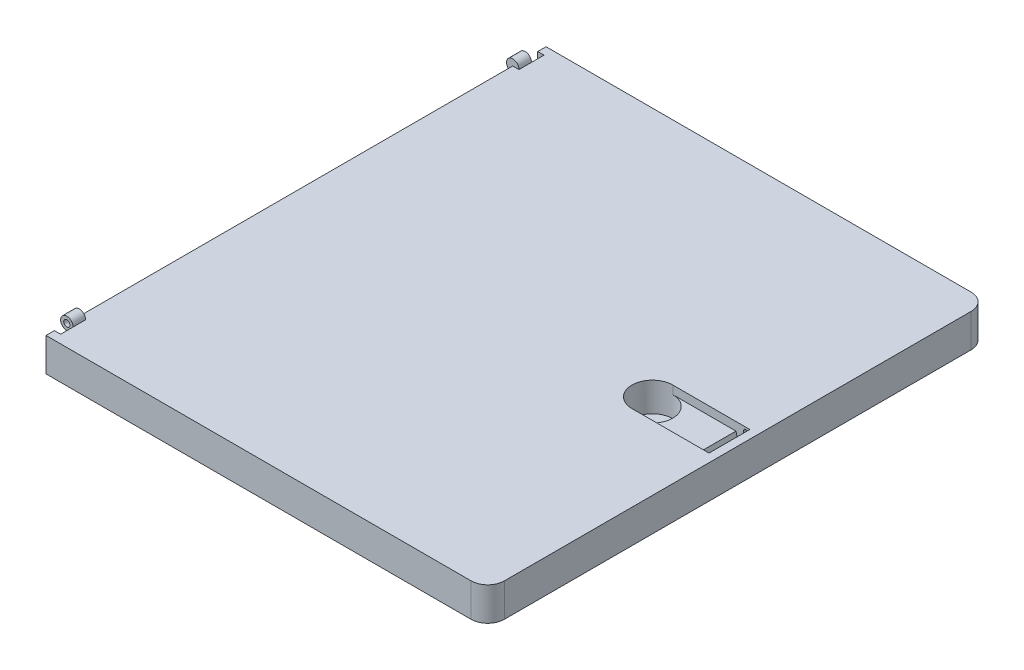
ISO-10303-21;
HEADER;
FILE_DESCRIPTION(('STEP AP214'),'2;1');
FILE_NAME('part.step','',(''),(''),'','','');
FILE_SCHEMA(('AUTOMOTIVE_DESIGN { 1 0 10303 214 1 1 1 1 }'));
ENDSEC;
DATA;
#1=APPLICATION_CONTEXT('core data for automotive mechanical design processes');
#2=APPLICATION_PROTOCOL_DEFINITION('international standard','automotive_design',2000,#1);
#3=PRODUCT_CONTEXT('',#1,'mechanical');
#4=PRODUCT('Part','Part','',(#3));
#5=PRODUCT_RELATED_PRODUCT_CATEGORY('part','',(#4));
#6=PRODUCT_DEFINITION_FORMATION('','',#4);
#7=PRODUCT_DEFINITION_CONTEXT('part definition',#1,'design');
#8=PRODUCT_DEFINITION('design','',#6,#7);
#9=PRODUCT_DEFINITION_SHAPE('','',#8);
#10=(LENGTH_UNIT() NAMED_UNIT(*) SI_UNIT(.MILLI.,.METRE.));
#11=(NAMED_UNIT(*) PLANE_ANGLE_UNIT() SI_UNIT($,.RADIAN.));
#12=(NAMED_UNIT(*) SI_UNIT($,.STERADIAN.) SOLID_ANGLE_UNIT());
#13=UNCERTAINTY_MEASURE_WITH_UNIT(LENGTH_MEASURE(1.E-05),#10,'distance_accuracy_value','');
#14=(GEOMETRIC_REPRESENTATION_CONTEXT(3) GLOBAL_UNCERTAINTY_ASSIGNED_CONTEXT((#13)) GLOBAL_UNIT_ASSIGNED_CONTEXT((#10,
#11,#12)) REPRESENTATION_CONTEXT('',''));
#15=CARTESIAN_POINT('',(0.,0.,0.));
#16=DIRECTION('',(0.,0.,1.));
#17=DIRECTION('',(1.,0.,0.));
#18=AXIS2_PLACEMENT_3D('',#15,#16,#17);
#19=CARTESIAN_POINT('',(-106.,-8.,0.));
#20=DIRECTION('',(-1.,0.,0.));
#21=DIRECTION('',(0.,0.,1.));
#22=AXIS2_PLACEMENT_3D('',#19,#20,#21);
#23=PLANE('',#22);
#24=DIRECTION('',(0.,0.,1.));
#25=VECTOR('',#24,1.);
#26=CARTESIAN_POINT('',(-106.,-1.5,-58.));
#27=LINE('',#26,#25);
#28=CARTESIAN_POINT('',(-106.,-1.5,-58.));
#29=VERTEX_POINT('',#28);
#30=CARTESIAN_POINT('',(-106.,-1.5,-55.));
#31=VERTEX_POINT('',#30);
#32=EDGE_CURVE('E225',#29,#31,#27,.T.);
#33=ORIENTED_EDGE('',*,*,#32,.F.);
#34=DIRECTION('',(0.,-1.,0.));
#35=VECTOR('',#34,1.);
#36=CARTESIAN_POINT('',(-106.,-8.,-58.));
#37=LINE('',#36,#35);
#38=CARTESIAN_POINT('',(-106.,0.,-58.));
#39=VERTEX_POINT('',#38);
#40=EDGE_CURVE('E457',#39,#29,#37,.T.);
#41=ORIENTED_EDGE('',*,*,#40,.F.);
#42=DIRECTION('',(0.,0.,1.));
#43=VECTOR('',#42,1.);
#44=CARTESIAN_POINT('',(-106.,0.,0.));
#45=LINE('',#44,#43);
#46=CARTESIAN_POINT('',(-106.,0.,-60.));
#47=VERTEX_POINT('',#46);
#48=EDGE_CURVE('E294',#47,#39,#45,.T.);
#49=ORIENTED_EDGE('',*,*,#48,.F.);
#50=DIRECTION('',(0.,1.,0.));
#51=VECTOR('',#50,1.);
#52=CARTESIAN_POINT('',(-106.,-8.,-60.));
#53=LINE('',#52,#51);
#54=CARTESIAN_POINT('',(-106.,-8.,-60.));
#55=VERTEX_POINT('',#54);
#56=EDGE_CURVE('E284',#55,#47,#53,.T.);
#57=ORIENTED_EDGE('',*,*,#56,.F.);
#58=DIRECTION('',(0.,0.,1.));
#59=VECTOR('',#58,1.);
#60=CARTESIAN_POINT('',(-106.,-8.,0.));
#61=LINE('',#60,#59);
#62=CARTESIAN_POINT('',(-106.,-8.,60.));
#63=VERTEX_POINT('',#62);
#64=EDGE_CURVE('E306',#55,#63,#61,.T.);
#65=ORIENTED_EDGE('',*,*,#64,.T.);
#66=DIRECTION('',(0.,1.,0.));
#67=VECTOR('',#66,1.);
#68=CARTESIAN_POINT('',(-106.,-8.,60.));
#69=LINE('',#68,#67);
#70=CARTESIAN_POINT('',(-106.,0.,60.));
#71=VERTEX_POINT('',#70);
#72=EDGE_CURVE('E283',#63,#71,#69,.T.);
#73=ORIENTED_EDGE('',*,*,#72,.T.);
#74=CARTESIAN_POINT('',(-106.,0.,58.));
#75=VERTEX_POINT('',#74);
#76=EDGE_CURVE('E297',#75,#71,#45,.T.);
#77=ORIENTED_EDGE('',*,*,#76,.F.);
#78=DIRECTION('',(0.,1.,0.));
#79=VECTOR('',#78,1.);
#80=CARTESIAN_POINT('',(-106.,-8.,58.));
#81=LINE('',#80,#79);
#82=CARTESIAN_POINT('',(-106.,-1.5,58.));
#83=VERTEX_POINT('',#82);
#84=EDGE_CURVE('E433',#83,#75,#81,.T.);
#85=ORIENTED_EDGE('',*,*,#84,.F.);
#86=DIRECTION('',(0.,0.,-1.));
#87=VECTOR('',#86,1.);
#88=CARTESIAN_POINT('',(-106.,-1.5,58.));
#89=LINE('',#88,#87);
#90=CARTESIAN_POINT('',(-106.,-1.5,55.));
#91=VERTEX_POINT('',#90);
#92=EDGE_CURVE('E437',#83,#91,#89,.T.);
#93=ORIENTED_EDGE('',*,*,#92,.T.);
#94=DIRECTION('',(0.,0.,1.));
#95=VECTOR('',#94,1.);
#96=CARTESIAN_POINT('',(-106.,-1.5,52.));
#97=LINE('',#96,#95);
#98=CARTESIAN_POINT('',(-106.,-1.5,52.));
#99=VERTEX_POINT('',#98);
#100=EDGE_CURVE('E407',#99,#91,#97,.T.);
#101=ORIENTED_EDGE('',*,*,#100,.F.);
#102=DIRECTION('',(0.,1.,0.));
#103=VECTOR('',#102,1.);
#104=CARTESIAN_POINT('',(-106.,-8.,52.));
#105=LINE('',#104,#103);
#106=CARTESIAN_POINT('',(-106.,0.,52.));
#107=VERTEX_POINT('',#106);
#108=EDGE_CURVE('E420',#99,#107,#105,.T.);
#109=ORIENTED_EDGE('',*,*,#108,.T.);
#110=CARTESIAN_POINT('',(-106.,0.,-52.));
#111=VERTEX_POINT('',#110);
#112=EDGE_CURVE('E296',#111,#107,#45,.T.);
#113=ORIENTED_EDGE('',*,*,#112,.F.);
#114=DIRECTION('',(0.,-1.,0.));
#115=VECTOR('',#114,1.);
#116=CARTESIAN_POINT('',(-106.,-8.,-52.));
#117=LINE('',#116,#115);
#118=CARTESIAN_POINT('',(-106.,-1.5,-52.));
#119=VERTEX_POINT('',#118);
#120=EDGE_CURVE('E450',#111,#119,#117,.T.);
#121=ORIENTED_EDGE('',*,*,#120,.T.);
#122=DIRECTION('',(0.,0.,-1.));
#123=VECTOR('',#122,1.);
#124=CARTESIAN_POINT('',(-106.,-1.5,-52.));
#125=LINE('',#124,#123);
#126=EDGE_CURVE('E446',#119,#31,#125,.T.);
#127=ORIENTED_EDGE('',*,*,#126,.T.);
#128=EDGE_LOOP('',(#33,#41,#49,#57,#65,#73,#77,#85,#93,#101,#109,#113,#121,#127));
#129=FACE_BOUND('',#128,.T.);
#130=ADVANCED_FACE('F33',(#129),#23,.T.);
#131=CARTESIAN_POINT('',(0.,0.,0.));
#132=DIRECTION('',(0.,-1.,0.));
#133=DIRECTION('',(0.,0.,-1.));
#134=AXIS2_PLACEMENT_3D('',#131,#132,#133);
#135=PLANE('',#134);
#136=DIRECTION('',(0.,0.,-1.));
#137=VECTOR('',#136,1.);
#138=CARTESIAN_POINT('',(-2.,0.,0.));
#139=LINE('',#138,#137);
#140=CARTESIAN_POINT('',(-2.,0.,4.9));
#141=VERTEX_POINT('',#140);
#142=CARTESIAN_POINT('',(-2.,0.,-4.9));
#143=VERTEX_POINT('',#142);
#144=EDGE_CURVE('E330',#141,#143,#139,.T.);
#145=ORIENTED_EDGE('',*,*,#144,.F.);
#146=DIRECTION('',(1.,0.,0.));
#147=VECTOR('',#146,1.);
#148=CARTESIAN_POINT('',(-2.,0.,4.9));
#149=LINE('',#148,#147);
#150=CARTESIAN_POINT('',(-20.5,0.,4.9));
#151=VERTEX_POINT('',#150);
#152=EDGE_CURVE('E321',#151,#141,#149,.T.);
#153=ORIENTED_EDGE('',*,*,#152,.F.);
#154=CARTESIAN_POINT('',(-20.5,0.,0.));
#155=DIRECTION('',(0.,1.,0.));
#156=DIRECTION('',(0.,0.,1.));
#157=AXIS2_PLACEMENT_3D('',#154,#155,#156);
#158=CIRCLE('',#157,4.9);
#159=CARTESIAN_POINT('',(-20.5,0.,-4.9));
#160=VERTEX_POINT('',#159);
#161=EDGE_CURVE('E324',#160,#151,#158,.T.);
#162=ORIENTED_EDGE('',*,*,#161,.F.);
#163=DIRECTION('',(-1.,0.,0.));
#164=VECTOR('',#163,1.);
#165=CARTESIAN_POINT('',(-2.,0.,-4.9));
#166=LINE('',#165,#164);
#167=EDGE_CURVE('E327',#143,#160,#166,.T.);
#168=ORIENTED_EDGE('',*,*,#167,.F.);
#169=EDGE_LOOP('',(#145,#153,#162,#168));
#170=FACE_BOUND('',#169,.T.);
#171=DIRECTION('',(1.,0.,0.));
#172=VECTOR('',#171,1.);
#173=CARTESIAN_POINT('',(0.,0.,-58.));
#174=LINE('',#173,#172);
#175=CARTESIAN_POINT('',(-104.5,0.,-58.));
#176=VERTEX_POINT('',#175);
#177=EDGE_CURVE('E11',#39,#176,#174,.T.);
#178=ORIENTED_EDGE('',*,*,#177,.T.);
#179=DIRECTION('',(0.,0.,1.));
#180=VECTOR('',#179,1.);
#181=CARTESIAN_POINT('',(-104.5,0.,-58.));
#182=LINE('',#181,#180);
#183=CARTESIAN_POINT('',(-104.5,0.,-55.));
#184=VERTEX_POINT('',#183);
#185=EDGE_CURVE('E222',#176,#184,#182,.T.);
#186=ORIENTED_EDGE('',*,*,#185,.T.);
#187=DIRECTION('',(0.,0.,-1.));
#188=VECTOR('',#187,1.);
#189=CARTESIAN_POINT('',(-104.5,0.,-52.));
#190=LINE('',#189,#188);
#191=CARTESIAN_POINT('',(-104.5,0.,-52.));
#192=VERTEX_POINT('',#191);
#193=EDGE_CURVE('E236',#192,#184,#190,.T.);
#194=ORIENTED_EDGE('',*,*,#193,.F.);
#195=DIRECTION('',(1.,0.,0.));
#196=VECTOR('',#195,1.);
#197=CARTESIAN_POINT('',(0.,0.,-52.));
#198=LINE('',#197,#196);
#199=EDGE_CURVE('E41',#111,#192,#198,.T.);
#200=ORIENTED_EDGE('',*,*,#199,.F.);
#201=ORIENTED_EDGE('',*,*,#112,.T.);
#202=DIRECTION('',(-1.,0.,0.));
#203=VECTOR('',#202,1.);
#204=CARTESIAN_POINT('',(0.,0.,52.));
#205=LINE('',#204,#203);
#206=CARTESIAN_POINT('',(-104.5,0.,52.));
#207=VERTEX_POINT('',#206);
#208=EDGE_CURVE('E253',#207,#107,#205,.T.);
#209=ORIENTED_EDGE('',*,*,#208,.F.);
#210=DIRECTION('',(0.,0.,1.));
#211=VECTOR('',#210,1.);
#212=CARTESIAN_POINT('',(-104.5,0.,52.));
#213=LINE('',#212,#211);
#214=CARTESIAN_POINT('',(-104.5,0.,55.));
#215=VERTEX_POINT('',#214);
#216=EDGE_CURVE('E258',#207,#215,#213,.T.);
#217=ORIENTED_EDGE('',*,*,#216,.T.);
#218=DIRECTION('',(0.,0.,-1.));
#219=VECTOR('',#218,1.);
#220=CARTESIAN_POINT('',(-104.5,0.,58.));
#221=LINE('',#220,#219);
#222=CARTESIAN_POINT('',(-104.5,0.,58.));
#223=VERTEX_POINT('',#222);
#224=EDGE_CURVE('E440',#223,#215,#221,.T.);
#225=ORIENTED_EDGE('',*,*,#224,.F.);
#226=DIRECTION('',(-1.,0.,0.));
#227=VECTOR('',#226,1.);
#228=CARTESIAN_POINT('',(0.,0.,58.));
#229=LINE('',#228,#227);
#230=EDGE_CURVE('E250',#223,#75,#229,.T.);
#231=ORIENTED_EDGE('',*,*,#230,.T.);
#232=ORIENTED_EDGE('',*,*,#76,.T.);
#233=DIRECTION('',(1.,0.,0.));
#234=VECTOR('',#233,1.);
#235=CARTESIAN_POINT('',(0.,0.,60.));
#236=LINE('',#235,#234);
#237=CARTESIAN_POINT('',(-4.,0.,60.));
#238=VERTEX_POINT('',#237);
#239=EDGE_CURVE('E290',#71,#238,#236,.T.);
#240=ORIENTED_EDGE('',*,*,#239,.T.);
#241=CARTESIAN_POINT('',(-4.,0.,56.));
#242=DIRECTION('',(0.,-1.,0.));
#243=DIRECTION('',(0.,0.,-1.));
#244=AXIS2_PLACEMENT_3D('',#241,#242,#243);
#245=CIRCLE('',#244,4.);
#246=CARTESIAN_POINT('',(0.,0.,56.));
#247=VERTEX_POINT('',#246);
#248=EDGE_CURVE('E276',#238,#247,#245,.F.);
#249=ORIENTED_EDGE('',*,*,#248,.T.);
#250=DIRECTION('',(0.,0.,-1.));
#251=VECTOR('',#250,1.);
#252=CARTESIAN_POINT('',(0.,0.,0.));
#253=LINE('',#252,#251);
#254=CARTESIAN_POINT('',(0.,0.,-56.));
#255=VERTEX_POINT('',#254);
#256=EDGE_CURVE('E300',#247,#255,#253,.T.);
#257=ORIENTED_EDGE('',*,*,#256,.T.);
#258=CARTESIAN_POINT('',(-4.,0.,-56.));
#259=DIRECTION('',(0.,-1.,0.));
#260=DIRECTION('',(0.,0.,-1.));
#261=AXIS2_PLACEMENT_3D('',#258,#259,#260);
#262=CIRCLE('',#261,4.);
#263=CARTESIAN_POINT('',(-4.,0.,-60.));
#264=VERTEX_POINT('',#263);
#265=EDGE_CURVE('E278',#255,#264,#262,.F.);
#266=ORIENTED_EDGE('',*,*,#265,.T.);
#267=DIRECTION('',(-1.,0.,0.));
#268=VECTOR('',#267,1.);
#269=CARTESIAN_POINT('',(0.,0.,-60.));
#270=LINE('',#269,#268);
#271=EDGE_CURVE('E298',#264,#47,#270,.T.);
#272=ORIENTED_EDGE('',*,*,#271,.T.);
#273=ORIENTED_EDGE('',*,*,#48,.T.);
#274=EDGE_LOOP('',(#178,#186,#194,#200,#201,#209,#217,#225,#231,#232,#240,#249,#257,#266,#272,#273));
#275=FACE_BOUND('',#274,.T.);
#276=ADVANCED_FACE('F233',(#170,#275),#135,.F.);
#277=CARTESIAN_POINT('',(0.,-8.,60.));
#278=DIRECTION('',(0.,0.,1.));
#279=DIRECTION('',(1.,0.,0.));
#280=AXIS2_PLACEMENT_3D('',#277,#278,#279);
#281=PLANE('',#280);
#282=DIRECTION('',(1.,0.,0.));
#283=VECTOR('',#282,1.);
#284=CARTESIAN_POINT('',(0.,-8.,60.));
#285=LINE('',#284,#283);
#286=CARTESIAN_POINT('',(-4.,-8.,60.));
#287=VERTEX_POINT('',#286);
#288=EDGE_CURVE('E287',#63,#287,#285,.T.);
#289=ORIENTED_EDGE('',*,*,#288,.T.);
#290=DIRECTION('',(0.,1.,0.));
#291=VECTOR('',#290,1.);
#292=CARTESIAN_POINT('',(-4.,-8.,60.));
#293=LINE('',#292,#291);
#294=EDGE_CURVE('E280',#287,#238,#293,.T.);
#295=ORIENTED_EDGE('',*,*,#294,.T.);
#296=ORIENTED_EDGE('',*,*,#239,.F.);
#297=ORIENTED_EDGE('',*,*,#72,.F.);
#298=EDGE_LOOP('',(#289,#295,#296,#297));
#299=FACE_BOUND('',#298,.T.);
#300=ADVANCED_FACE('F481',(#299),#281,.T.);
#301=CARTESIAN_POINT('',(0.,-8.,-60.));
#302=DIRECTION('',(0.,0.,-1.));
#303=DIRECTION('',(-1.,0.,0.));
#304=AXIS2_PLACEMENT_3D('',#301,#302,#303);
#305=PLANE('',#304);
#306=ORIENTED_EDGE('',*,*,#271,.F.);
#307=DIRECTION('',(0.,1.,0.));
#308=VECTOR('',#307,1.);
#309=CARTESIAN_POINT('',(-4.,-8.,-60.));
#310=LINE('',#309,#308);
#311=CARTESIAN_POINT('',(-4.,-8.,-60.));
#312=VERTEX_POINT('',#311);
#313=EDGE_CURVE('E265',#264,#312,#310,.F.);
#314=ORIENTED_EDGE('',*,*,#313,.T.);
#315=DIRECTION('',(-1.,0.,0.));
#316=VECTOR('',#315,1.);
#317=CARTESIAN_POINT('',(0.,-8.,-60.));
#318=LINE('',#317,#316);
#319=EDGE_CURVE('E308',#312,#55,#318,.T.);
#320=ORIENTED_EDGE('',*,*,#319,.T.);
#321=ORIENTED_EDGE('',*,*,#56,.T.);
#322=EDGE_LOOP('',(#306,#314,#320,#321));
#323=FACE_BOUND('',#322,.T.);
#324=ADVANCED_FACE('F498',(#323),#305,.T.);
#325=CARTESIAN_POINT('',(0.,-8.,0.));
#326=DIRECTION('',(1.,0.,0.));
#327=DIRECTION('',(0.,0.,-1.));
#328=AXIS2_PLACEMENT_3D('',#325,#326,#327);
#329=PLANE('',#328);
#330=ORIENTED_EDGE('',*,*,#256,.F.);
#331=DIRECTION('',(0.,1.,0.));
#332=VECTOR('',#331,1.);
#333=CARTESIAN_POINT('',(0.,-8.,56.));
#334=LINE('',#333,#332);
#335=CARTESIAN_POINT('',(0.,-8.,56.));
#336=VERTEX_POINT('',#335);
#337=EDGE_CURVE('E271',#247,#336,#334,.F.);
#338=ORIENTED_EDGE('',*,*,#337,.T.);
#339=DIRECTION('',(0.,0.,-1.));
#340=VECTOR('',#339,1.);
#341=CARTESIAN_POINT('',(0.,-8.,0.));
#342=LINE('',#341,#340);
#343=CARTESIAN_POINT('',(0.,-8.,-56.));
#344=VERTEX_POINT('',#343);
#345=EDGE_CURVE('E293',#336,#344,#342,.T.);
#346=ORIENTED_EDGE('',*,*,#345,.T.);
#347=DIRECTION('',(0.,1.,0.));
#348=VECTOR('',#347,1.);
#349=CARTESIAN_POINT('',(0.,-8.,-56.));
#350=LINE('',#349,#348);
#351=EDGE_CURVE('E273',#344,#255,#350,.T.);
#352=ORIENTED_EDGE('',*,*,#351,.T.);
#353=EDGE_LOOP('',(#330,#338,#346,#352));
#354=FACE_BOUND('',#353,.T.);
#355=ADVANCED_FACE('F489',(#354),#329,.T.);
#356=CARTESIAN_POINT('',(0.,-8.,0.));
#357=DIRECTION('',(0.,-1.,0.));
#358=DIRECTION('',(0.,0.,-1.));
#359=AXIS2_PLACEMENT_3D('',#356,#357,#358);
#360=PLANE('',#359);
#361=ORIENTED_EDGE('',*,*,#345,.F.);
#362=CARTESIAN_POINT('',(-4.,-8.,56.));
#363=DIRECTION('',(0.,-1.,0.));
#364=DIRECTION('',(0.,0.,-1.));
#365=AXIS2_PLACEMENT_3D('',#362,#363,#364);
#366=CIRCLE('',#365,4.);
#367=EDGE_CURVE('E267',#336,#287,#366,.T.);
#368=ORIENTED_EDGE('',*,*,#367,.T.);
#369=ORIENTED_EDGE('',*,*,#288,.F.);
#370=ORIENTED_EDGE('',*,*,#64,.F.);
#371=ORIENTED_EDGE('',*,*,#319,.F.);
#372=CARTESIAN_POINT('',(-4.,-8.,-56.));
#373=DIRECTION('',(0.,-1.,0.));
#374=DIRECTION('',(0.,0.,-1.));
#375=AXIS2_PLACEMENT_3D('',#372,#373,#374);
#376=CIRCLE('',#375,4.);
#377=EDGE_CURVE('E269',#312,#344,#376,.T.);
#378=ORIENTED_EDGE('',*,*,#377,.T.);
#379=EDGE_LOOP('',(#361,#368,#369,#370,#371,#378));
#380=FACE_BOUND('',#379,.T.);
#381=ADVANCED_FACE('F501',(#380),#360,.T.);
#382=CARTESIAN_POINT('',(-4.,-8.,56.));
#383=DIRECTION('',(0.,1.,0.));
#384=DIRECTION('',(0.,0.,1.));
#385=AXIS2_PLACEMENT_3D('',#382,#383,#384);
#386=CYLINDRICAL_SURFACE('',#385,4.);
#387=ORIENTED_EDGE('',*,*,#367,.F.);
#388=ORIENTED_EDGE('',*,*,#337,.F.);
#389=ORIENTED_EDGE('',*,*,#248,.F.);
#390=ORIENTED_EDGE('',*,*,#294,.F.);
#391=EDGE_LOOP('',(#387,#388,#389,#390));
#392=FACE_BOUND('',#391,.T.);
#393=ADVANCED_FACE('F485',(#392),#386,.T.);
#394=CARTESIAN_POINT('',(-4.,-8.,-56.));
#395=DIRECTION('',(0.,1.,0.));
#396=DIRECTION('',(0.,0.,1.));
#397=AXIS2_PLACEMENT_3D('',#394,#395,#396);
#398=CYLINDRICAL_SURFACE('',#397,4.);
#399=ORIENTED_EDGE('',*,*,#377,.F.);
#400=ORIENTED_EDGE('',*,*,#313,.F.);
#401=ORIENTED_EDGE('',*,*,#265,.F.);
#402=ORIENTED_EDGE('',*,*,#351,.F.);
#403=EDGE_LOOP('',(#399,#400,#401,#402));
#404=FACE_BOUND('',#403,.T.);
#405=ADVANCED_FACE('F494',(#404),#398,.T.);
#406=CARTESIAN_POINT('',(-2.,-2.,4.9));
#407=DIRECTION('',(0.,0.,1.));
#408=DIRECTION('',(1.,0.,0.));
#409=AXIS2_PLACEMENT_3D('',#406,#407,#408);
#410=PLANE('',#409);
#411=DIRECTION('',(0.,-1.,0.));
#412=VECTOR('',#411,1.);
#413=CARTESIAN_POINT('',(-2.5,-1.,4.9));
#414=LINE('',#413,#412);
#415=CARTESIAN_POINT('',(-2.5,-1.,4.9));
#416=VERTEX_POINT('',#415);
#417=CARTESIAN_POINT('',(-2.5,-6.,4.9));
#418=VERTEX_POINT('',#417);
#419=EDGE_CURVE('E402',#416,#418,#414,.T.);
#420=ORIENTED_EDGE('',*,*,#419,.F.);
#421=CARTESIAN_POINT('',(-3.,-1.,4.9));
#422=DIRECTION('',(0.,0.,-1.));
#423=DIRECTION('',(-1.,0.,0.));
#424=AXIS2_PLACEMENT_3D('',#421,#422,#423);
#425=CIRCLE('',#424,0.5);
#426=CARTESIAN_POINT('',(-3.5,-1.,4.9));
#427=VERTEX_POINT('',#426);
#428=EDGE_CURVE('E405',#427,#416,#425,.T.);
#429=ORIENTED_EDGE('',*,*,#428,.F.);
#430=DIRECTION('',(0.,1.,0.));
#431=VECTOR('',#430,1.);
#432=CARTESIAN_POINT('',(-3.5,-1.,4.9));
#433=LINE('',#432,#431);
#434=CARTESIAN_POINT('',(-3.5,-6.,4.9));
#435=VERTEX_POINT('',#434);
#436=EDGE_CURVE('E395',#435,#427,#433,.T.);
#437=ORIENTED_EDGE('',*,*,#436,.F.);
#438=CARTESIAN_POINT('',(-3.,-6.,4.9));
#439=DIRECTION('',(0.,0.,-1.));
#440=DIRECTION('',(-1.,0.,0.));
#441=AXIS2_PLACEMENT_3D('',#438,#439,#440);
#442=CIRCLE('',#441,0.5);
#443=EDGE_CURVE('E399',#418,#435,#442,.T.);
#444=ORIENTED_EDGE('',*,*,#443,.F.);
#445=EDGE_LOOP('',(#420,#429,#437,#444));
#446=FACE_BOUND('',#445,.T.);
#447=ORIENTED_EDGE('',*,*,#152,.T.);
#448=DIRECTION('',(0.,1.,0.));
#449=VECTOR('',#448,1.);
#450=CARTESIAN_POINT('',(-2.,-2.,4.9));
#451=LINE('',#450,#449);
#452=CARTESIAN_POINT('',(-2.,-7.,4.9));
#453=VERTEX_POINT('',#452);
#454=EDGE_CURVE('E303',#453,#141,#451,.T.);
#455=ORIENTED_EDGE('',*,*,#454,.F.);
#456=DIRECTION('',(1.,0.,0.));
#457=VECTOR('',#456,1.);
#458=CARTESIAN_POINT('',(-2.,-7.,4.9));
#459=LINE('',#458,#457);
#460=CARTESIAN_POINT('',(-4.,-7.,4.9));
#461=VERTEX_POINT('',#460);
#462=EDGE_CURVE('E339',#461,#453,#459,.T.);
#463=ORIENTED_EDGE('',*,*,#462,.F.);
#464=DIRECTION('',(-0.258819045102518,0.965925826289069,0.));
#465=VECTOR('',#464,1.);
#466=CARTESIAN_POINT('',(-5.11602540378444,-2.83493649053889,4.9));
#467=LINE('',#466,#465);
#468=CARTESIAN_POINT('',(-5.33974596215561,-2.,4.9));
#469=VERTEX_POINT('',#468);
#470=EDGE_CURVE('E48',#461,#469,#467,.T.);
#471=ORIENTED_EDGE('',*,*,#470,.T.);
#472=DIRECTION('',(1.,0.,0.));
#473=VECTOR('',#472,1.);
#474=CARTESIAN_POINT('',(-2.,-2.,4.9));
#475=LINE('',#474,#473);
#476=CARTESIAN_POINT('',(-20.5,-2.,4.9));
#477=VERTEX_POINT('',#476);
#478=EDGE_CURVE('E315',#477,#469,#475,.T.);
#479=ORIENTED_EDGE('',*,*,#478,.F.);
#480=DIRECTION('',(0.,1.,0.));
#481=VECTOR('',#480,1.);
#482=CARTESIAN_POINT('',(-20.5,-2.,4.9));
#483=LINE('',#482,#481);
#484=EDGE_CURVE('E317',#477,#151,#483,.T.);
#485=ORIENTED_EDGE('',*,*,#484,.T.);
#486=EDGE_LOOP('',(#447,#455,#463,#471,#479,#485));
#487=FACE_BOUND('',#486,.T.);
#488=ADVANCED_FACE('F522',(#446,#487),#410,.F.);
#489=CARTESIAN_POINT('',(-20.5,-2.,0.));
#490=DIRECTION('',(0.,1.,0.));
#491=DIRECTION('',(0.,0.,1.));
#492=AXIS2_PLACEMENT_3D('',#489,#490,#491);
#493=CYLINDRICAL_SURFACE('',#492,4.9);
#494=ORIENTED_EDGE('',*,*,#161,.T.);
#495=ORIENTED_EDGE('',*,*,#484,.F.);
#496=CARTESIAN_POINT('',(-20.5,-2.,0.));
#497=DIRECTION('',(0.,1.,0.));
#498=DIRECTION('',(0.,0.,1.));
#499=AXIS2_PLACEMENT_3D('',#496,#497,#498);
#500=CIRCLE('',#499,4.9);
#501=CARTESIAN_POINT('',(-20.5,-2.,-4.9));
#502=VERTEX_POINT('',#501);
#503=EDGE_CURVE('E336',#477,#502,#500,.T.);
#504=ORIENTED_EDGE('',*,*,#503,.T.);
#505=DIRECTION('',(0.,1.,0.));
#506=VECTOR('',#505,1.);
#507=CARTESIAN_POINT('',(-20.5,-2.,-4.9));
#508=LINE('',#507,#506);
#509=EDGE_CURVE('E314',#502,#160,#508,.T.);
#510=ORIENTED_EDGE('',*,*,#509,.T.);
#511=EDGE_LOOP('',(#494,#495,#504,#510));
#512=FACE_BOUND('',#511,.T.);
#513=CARTESIAN_POINT('',(-20.5,-7.,0.));
#514=DIRECTION('',(0.,1.,0.));
#515=DIRECTION('',(0.,0.,1.));
#516=AXIS2_PLACEMENT_3D('',#513,#514,#515);
#517=CIRCLE('',#516,4.9);
#518=CARTESIAN_POINT('',(-20.5,-7.,4.9));
#519=VERTEX_POINT('',#518);
#520=EDGE_CURVE('E333',#519,#519,#517,.T.);
#521=ORIENTED_EDGE('',*,*,#520,.F.);
#522=EDGE_LOOP('',(#521));
#523=FACE_BOUND('',#522,.T.);
#524=ADVANCED_FACE('F526',(#512,#523),#493,.F.);
#525=CARTESIAN_POINT('',(-2.,-2.,-4.9));
#526=DIRECTION('',(0.,0.,-1.));
#527=DIRECTION('',(-1.,0.,0.));
#528=AXIS2_PLACEMENT_3D('',#525,#526,#527);
#529=PLANE('',#528);
#530=DIRECTION('',(0.,-1.,0.));
#531=VECTOR('',#530,1.);
#532=CARTESIAN_POINT('',(-3.5,-1.,-4.9));
#533=LINE('',#532,#531);
#534=CARTESIAN_POINT('',(-3.5,-1.,-4.9));
#535=VERTEX_POINT('',#534);
#536=CARTESIAN_POINT('',(-3.5,-6.,-4.9));
#537=VERTEX_POINT('',#536);
#538=EDGE_CURVE('E370',#535,#537,#533,.T.);
#539=ORIENTED_EDGE('',*,*,#538,.F.);
#540=CARTESIAN_POINT('',(-3.,-1.,-4.9));
#541=DIRECTION('',(0.,0.,1.));
#542=DIRECTION('',(1.,0.,0.));
#543=AXIS2_PLACEMENT_3D('',#540,#541,#542);
#544=CIRCLE('',#543,0.5);
#545=CARTESIAN_POINT('',(-2.5,-1.,-4.9));
#546=VERTEX_POINT('',#545);
#547=EDGE_CURVE('E373',#546,#535,#544,.T.);
#548=ORIENTED_EDGE('',*,*,#547,.F.);
#549=DIRECTION('',(0.,1.,0.));
#550=VECTOR('',#549,1.);
#551=CARTESIAN_POINT('',(-2.5,-6.,-4.9));
#552=LINE('',#551,#550);
#553=CARTESIAN_POINT('',(-2.5,-6.,-4.9));
#554=VERTEX_POINT('',#553);
#555=EDGE_CURVE('E363',#554,#546,#552,.T.);
#556=ORIENTED_EDGE('',*,*,#555,.F.);
#557=CARTESIAN_POINT('',(-3.,-6.,-4.9));
#558=DIRECTION('',(0.,0.,1.));
#559=DIRECTION('',(1.,0.,0.));
#560=AXIS2_PLACEMENT_3D('',#557,#558,#559);
#561=CIRCLE('',#560,0.5);
#562=EDGE_CURVE('E367',#537,#554,#561,.T.);
#563=ORIENTED_EDGE('',*,*,#562,.F.);
#564=EDGE_LOOP('',(#539,#548,#556,#563));
#565=FACE_BOUND('',#564,.T.);
#566=ORIENTED_EDGE('',*,*,#167,.T.);
#567=ORIENTED_EDGE('',*,*,#509,.F.);
#568=DIRECTION('',(-1.,0.,0.));
#569=VECTOR('',#568,1.);
#570=CARTESIAN_POINT('',(-2.,-2.,-4.9));
#571=LINE('',#570,#569);
#572=CARTESIAN_POINT('',(-5.33974596215561,-2.,-4.9));
#573=VERTEX_POINT('',#572);
#574=EDGE_CURVE('E323',#573,#502,#571,.T.);
#575=ORIENTED_EDGE('',*,*,#574,.F.);
#576=DIRECTION('',(0.258819045102518,-0.965925826289069,0.));
#577=VECTOR('',#576,1.);
#578=CARTESIAN_POINT('',(-5.11602540378444,-2.83493649053889,-4.9));
#579=LINE('',#578,#577);
#580=CARTESIAN_POINT('',(-4.,-7.,-4.9));
#581=VERTEX_POINT('',#580);
#582=EDGE_CURVE('E261',#573,#581,#579,.T.);
#583=ORIENTED_EDGE('',*,*,#582,.T.);
#584=DIRECTION('',(-1.,0.,0.));
#585=VECTOR('',#584,1.);
#586=CARTESIAN_POINT('',(-2.,-7.,-4.9));
#587=LINE('',#586,#585);
#588=CARTESIAN_POINT('',(-2.,-7.,-4.9));
#589=VERTEX_POINT('',#588);
#590=EDGE_CURVE('E347',#589,#581,#587,.T.);
#591=ORIENTED_EDGE('',*,*,#590,.F.);
#592=DIRECTION('',(0.,1.,0.));
#593=VECTOR('',#592,1.);
#594=CARTESIAN_POINT('',(-2.,-2.,-4.9));
#595=LINE('',#594,#593);
#596=EDGE_CURVE('E312',#589,#143,#595,.T.);
#597=ORIENTED_EDGE('',*,*,#596,.T.);
#598=EDGE_LOOP('',(#566,#567,#575,#583,#591,#597));
#599=FACE_BOUND('',#598,.T.);
#600=ADVANCED_FACE('F532',(#565,#599),#529,.F.);
#601=CARTESIAN_POINT('',(-2.,-2.,0.));
#602=DIRECTION('',(1.,0.,0.));
#603=DIRECTION('',(0.,0.,-1.));
#604=AXIS2_PLACEMENT_3D('',#601,#602,#603);
#605=PLANE('',#604);
#606=ORIENTED_EDGE('',*,*,#144,.T.);
#607=ORIENTED_EDGE('',*,*,#596,.F.);
#608=DIRECTION('',(0.,0.,-1.));
#609=VECTOR('',#608,1.);
#610=CARTESIAN_POINT('',(-2.,-7.,-4.9));
#611=LINE('',#610,#609);
#612=EDGE_CURVE('E350',#453,#589,#611,.T.);
#613=ORIENTED_EDGE('',*,*,#612,.F.);
#614=ORIENTED_EDGE('',*,*,#454,.T.);
#615=EDGE_LOOP('',(#606,#607,#613,#614));
#616=FACE_BOUND('',#615,.T.);
#617=ADVANCED_FACE('F541',(#616),#605,.F.);
#618=CARTESIAN_POINT('',(-20.5,-2.,0.));
#619=DIRECTION('',(0.,1.,0.));
#620=DIRECTION('',(0.,0.,1.));
#621=AXIS2_PLACEMENT_3D('',#618,#619,#620);
#622=PLANE('',#621);
#623=ORIENTED_EDGE('',*,*,#478,.T.);
#624=DIRECTION('',(0.,0.,-1.));
#625=VECTOR('',#624,1.);
#626=CARTESIAN_POINT('',(-5.33974596215561,-2.,-4.9));
#627=LINE('',#626,#625);
#628=EDGE_CURVE('E55',#469,#573,#627,.T.);
#629=ORIENTED_EDGE('',*,*,#628,.T.);
#630=ORIENTED_EDGE('',*,*,#574,.T.);
#631=ORIENTED_EDGE('',*,*,#503,.F.);
#632=EDGE_LOOP('',(#623,#629,#630,#631));
#633=FACE_BOUND('',#632,.T.);
#634=ADVANCED_FACE('F537',(#633),#622,.T.);
#635=CARTESIAN_POINT('',(-20.5,-7.,0.));
#636=DIRECTION('',(0.,1.,0.));
#637=DIRECTION('',(0.,0.,1.));
#638=AXIS2_PLACEMENT_3D('',#635,#636,#637);
#639=PLANE('',#638);
#640=ORIENTED_EDGE('',*,*,#520,.T.);
#641=EDGE_LOOP('',(#640));
#642=FACE_BOUND('',#641,.T.);
#643=ADVANCED_FACE('F548',(#642),#639,.T.);
#644=CARTESIAN_POINT('',(0.,-7.,0.));
#645=DIRECTION('',(0.,-1.,0.));
#646=DIRECTION('',(0.,0.,-1.));
#647=AXIS2_PLACEMENT_3D('',#644,#645,#646);
#648=PLANE('',#647);
#649=ORIENTED_EDGE('',*,*,#612,.T.);
#650=ORIENTED_EDGE('',*,*,#590,.T.);
#651=DIRECTION('',(0.,0.,1.));
#652=VECTOR('',#651,1.);
#653=CARTESIAN_POINT('',(-4.,-7.,-4.9));
#654=LINE('',#653,#652);
#655=EDGE_CURVE('E344',#581,#461,#654,.T.);
#656=ORIENTED_EDGE('',*,*,#655,.T.);
#657=ORIENTED_EDGE('',*,*,#462,.T.);
#658=EDGE_LOOP('',(#649,#650,#656,#657));
#659=FACE_BOUND('',#658,.T.);
#660=ADVANCED_FACE('F560',(#659),#648,.F.);
#661=CARTESIAN_POINT('',(-3.,-1.,-6.9));
#662=DIRECTION('',(0.,0.,1.));
#663=DIRECTION('',(1.,0.,0.));
#664=AXIS2_PLACEMENT_3D('',#661,#662,#663);
#665=CYLINDRICAL_SURFACE('',#664,0.5);
#666=ORIENTED_EDGE('',*,*,#547,.T.);
#667=DIRECTION('',(0.,0.,1.));
#668=VECTOR('',#667,1.);
#669=CARTESIAN_POINT('',(-3.5,-1.,-6.9));
#670=LINE('',#669,#668);
#671=CARTESIAN_POINT('',(-3.5,-1.,-6.9));
#672=VERTEX_POINT('',#671);
#673=EDGE_CURVE('E354',#672,#535,#670,.T.);
#674=ORIENTED_EDGE('',*,*,#673,.F.);
#675=CARTESIAN_POINT('',(-3.,-1.,-6.9));
#676=DIRECTION('',(0.,0.,1.));
#677=DIRECTION('',(1.,0.,0.));
#678=AXIS2_PLACEMENT_3D('',#675,#676,#677);
#679=CIRCLE('',#678,0.5);
#680=CARTESIAN_POINT('',(-2.5,-1.,-6.9));
#681=VERTEX_POINT('',#680);
#682=EDGE_CURVE('E366',#681,#672,#679,.T.);
#683=ORIENTED_EDGE('',*,*,#682,.F.);
#684=DIRECTION('',(0.,0.,1.));
#685=VECTOR('',#684,1.);
#686=CARTESIAN_POINT('',(-2.5,-1.,-6.9));
#687=LINE('',#686,#685);
#688=EDGE_CURVE('E353',#681,#546,#687,.T.);
#689=ORIENTED_EDGE('',*,*,#688,.T.);
#690=EDGE_LOOP('',(#666,#674,#683,#689));
#691=FACE_BOUND('',#690,.T.);
#692=ADVANCED_FACE('F605',(#691),#665,.F.);
#693=CARTESIAN_POINT('',(-2.5,-6.,-6.9));
#694=DIRECTION('',(1.,0.,0.));
#695=DIRECTION('',(0.,0.,-1.));
#696=AXIS2_PLACEMENT_3D('',#693,#694,#695);
#697=PLANE('',#696);
#698=ORIENTED_EDGE('',*,*,#555,.T.);
#699=ORIENTED_EDGE('',*,*,#688,.F.);
#700=DIRECTION('',(0.,1.,0.));
#701=VECTOR('',#700,1.);
#702=CARTESIAN_POINT('',(-2.5,-6.,-6.9));
#703=LINE('',#702,#701);
#704=CARTESIAN_POINT('',(-2.5,-6.,-6.9));
#705=VERTEX_POINT('',#704);
#706=EDGE_CURVE('E358',#705,#681,#703,.T.);
#707=ORIENTED_EDGE('',*,*,#706,.F.);
#708=DIRECTION('',(0.,0.,1.));
#709=VECTOR('',#708,1.);
#710=CARTESIAN_POINT('',(-2.5,-6.,-6.9));
#711=LINE('',#710,#709);
#712=EDGE_CURVE('E360',#705,#554,#711,.T.);
#713=ORIENTED_EDGE('',*,*,#712,.T.);
#714=EDGE_LOOP('',(#698,#699,#707,#713));
#715=FACE_BOUND('',#714,.T.);
#716=ADVANCED_FACE('F601',(#715),#697,.F.);
#717=CARTESIAN_POINT('',(-3.,-6.,-6.9));
#718=DIRECTION('',(0.,0.,1.));
#719=DIRECTION('',(1.,0.,0.));
#720=AXIS2_PLACEMENT_3D('',#717,#718,#719);
#721=CYLINDRICAL_SURFACE('',#720,0.5);
#722=ORIENTED_EDGE('',*,*,#562,.T.);
#723=ORIENTED_EDGE('',*,*,#712,.F.);
#724=CARTESIAN_POINT('',(-3.,-6.,-6.9));
#725=DIRECTION('',(0.,0.,1.));
#726=DIRECTION('',(1.,0.,0.));
#727=AXIS2_PLACEMENT_3D('',#724,#725,#726);
#728=CIRCLE('',#727,0.5);
#729=CARTESIAN_POINT('',(-3.5,-6.,-6.9));
#730=VERTEX_POINT('',#729);
#731=EDGE_CURVE('E378',#730,#705,#728,.T.);
#732=ORIENTED_EDGE('',*,*,#731,.F.);
#733=DIRECTION('',(0.,0.,1.));
#734=VECTOR('',#733,1.);
#735=CARTESIAN_POINT('',(-3.5,-6.,-6.9));
#736=LINE('',#735,#734);
#737=EDGE_CURVE('E357',#730,#537,#736,.T.);
#738=ORIENTED_EDGE('',*,*,#737,.T.);
#739=EDGE_LOOP('',(#722,#723,#732,#738));
#740=FACE_BOUND('',#739,.T.);
#741=ADVANCED_FACE('F604',(#740),#721,.F.);
#742=CARTESIAN_POINT('',(-3.5,-1.,-6.9));
#743=DIRECTION('',(-1.,0.,0.));
#744=DIRECTION('',(0.,0.,1.));
#745=AXIS2_PLACEMENT_3D('',#742,#743,#744);
#746=PLANE('',#745);
#747=ORIENTED_EDGE('',*,*,#538,.T.);
#748=ORIENTED_EDGE('',*,*,#737,.F.);
#749=DIRECTION('',(0.,-1.,0.));
#750=VECTOR('',#749,1.);
#751=CARTESIAN_POINT('',(-3.5,-1.,-6.9));
#752=LINE('',#751,#750);
#753=EDGE_CURVE('E381',#672,#730,#752,.T.);
#754=ORIENTED_EDGE('',*,*,#753,.F.);
#755=ORIENTED_EDGE('',*,*,#673,.T.);
#756=EDGE_LOOP('',(#747,#748,#754,#755));
#757=FACE_BOUND('',#756,.T.);
#758=ADVANCED_FACE('F599',(#757),#746,.F.);
#759=CARTESIAN_POINT('',(-3.,-1.,-6.9));
#760=DIRECTION('',(0.,0.,1.));
#761=DIRECTION('',(1.,0.,0.));
#762=AXIS2_PLACEMENT_3D('',#759,#760,#761);
#763=PLANE('',#762);
#764=ORIENTED_EDGE('',*,*,#682,.T.);
#765=ORIENTED_EDGE('',*,*,#753,.T.);
#766=ORIENTED_EDGE('',*,*,#731,.T.);
#767=ORIENTED_EDGE('',*,*,#706,.T.);
#768=EDGE_LOOP('',(#764,#765,#766,#767));
#769=FACE_BOUND('',#768,.T.);
#770=ADVANCED_FACE('F595',(#769),#763,.T.);
#771=CARTESIAN_POINT('',(-3.,-1.,6.9));
#772=DIRECTION('',(0.,0.,-1.));
#773=DIRECTION('',(-1.,0.,0.));
#774=AXIS2_PLACEMENT_3D('',#771,#772,#773);
#775=CYLINDRICAL_SURFACE('',#774,0.5);
#776=ORIENTED_EDGE('',*,*,#428,.T.);
#777=DIRECTION('',(0.,0.,-1.));
#778=VECTOR('',#777,1.);
#779=CARTESIAN_POINT('',(-2.5,-1.,6.9));
#780=LINE('',#779,#778);
#781=CARTESIAN_POINT('',(-2.5,-1.,6.9));
#782=VERTEX_POINT('',#781);
#783=EDGE_CURVE('E386',#782,#416,#780,.T.);
#784=ORIENTED_EDGE('',*,*,#783,.F.);
#785=CARTESIAN_POINT('',(-3.,-1.,6.9));
#786=DIRECTION('',(0.,0.,-1.));
#787=DIRECTION('',(-1.,0.,0.));
#788=AXIS2_PLACEMENT_3D('',#785,#786,#787);
#789=CIRCLE('',#788,0.5);
#790=CARTESIAN_POINT('',(-3.5,-1.,6.9));
#791=VERTEX_POINT('',#790);
#792=EDGE_CURVE('E398',#791,#782,#789,.T.);
#793=ORIENTED_EDGE('',*,*,#792,.F.);
#794=DIRECTION('',(0.,0.,-1.));
#795=VECTOR('',#794,1.);
#796=CARTESIAN_POINT('',(-3.5,-1.,6.9));
#797=LINE('',#796,#795);
#798=EDGE_CURVE('E375',#791,#427,#797,.T.);
#799=ORIENTED_EDGE('',*,*,#798,.T.);
#800=EDGE_LOOP('',(#776,#784,#793,#799));
#801=FACE_BOUND('',#800,.T.);
#802=ADVANCED_FACE('F588',(#801),#775,.F.);
#803=CARTESIAN_POINT('',(-3.5,-1.,6.9));
#804=DIRECTION('',(-1.,0.,0.));
#805=DIRECTION('',(0.,0.,1.));
#806=AXIS2_PLACEMENT_3D('',#803,#804,#805);
#807=PLANE('',#806);
#808=ORIENTED_EDGE('',*,*,#436,.T.);
#809=ORIENTED_EDGE('',*,*,#798,.F.);
#810=DIRECTION('',(0.,1.,0.));
#811=VECTOR('',#810,1.);
#812=CARTESIAN_POINT('',(-3.5,-1.,6.9));
#813=LINE('',#812,#811);
#814=CARTESIAN_POINT('',(-3.5,-6.,6.9));
#815=VERTEX_POINT('',#814);
#816=EDGE_CURVE('E390',#815,#791,#813,.T.);
#817=ORIENTED_EDGE('',*,*,#816,.F.);
#818=DIRECTION('',(0.,0.,-1.));
#819=VECTOR('',#818,1.);
#820=CARTESIAN_POINT('',(-3.5,-6.,6.9));
#821=LINE('',#820,#819);
#822=EDGE_CURVE('E392',#815,#435,#821,.T.);
#823=ORIENTED_EDGE('',*,*,#822,.T.);
#824=EDGE_LOOP('',(#808,#809,#817,#823));
#825=FACE_BOUND('',#824,.T.);
#826=ADVANCED_FACE('F585',(#825),#807,.F.);
#827=CARTESIAN_POINT('',(-3.,-6.,6.9));
#828=DIRECTION('',(0.,0.,-1.));
#829=DIRECTION('',(-1.,0.,0.));
#830=AXIS2_PLACEMENT_3D('',#827,#828,#829);
#831=CYLINDRICAL_SURFACE('',#830,0.5);
#832=ORIENTED_EDGE('',*,*,#443,.T.);
#833=ORIENTED_EDGE('',*,*,#822,.F.);
#834=CARTESIAN_POINT('',(-3.,-6.,6.9));
#835=DIRECTION('',(0.,0.,-1.));
#836=DIRECTION('',(-1.,0.,0.));
#837=AXIS2_PLACEMENT_3D('',#834,#835,#836);
#838=CIRCLE('',#837,0.5);
#839=CARTESIAN_POINT('',(-2.5,-6.,6.9));
#840=VERTEX_POINT('',#839);
#841=EDGE_CURVE('E410',#840,#815,#838,.T.);
#842=ORIENTED_EDGE('',*,*,#841,.F.);
#843=DIRECTION('',(0.,0.,-1.));
#844=VECTOR('',#843,1.);
#845=CARTESIAN_POINT('',(-2.5,-6.,6.9));
#846=LINE('',#845,#844);
#847=EDGE_CURVE('E389',#840,#418,#846,.T.);
#848=ORIENTED_EDGE('',*,*,#847,.T.);
#849=EDGE_LOOP('',(#832,#833,#842,#848));
#850=FACE_BOUND('',#849,.T.);
#851=ADVANCED_FACE('F580',(#850),#831,.F.);
#852=CARTESIAN_POINT('',(-2.5,-1.,6.9));
#853=DIRECTION('',(1.,0.,0.));
#854=DIRECTION('',(0.,0.,-1.));
#855=AXIS2_PLACEMENT_3D('',#852,#853,#854);
#856=PLANE('',#855);
#857=ORIENTED_EDGE('',*,*,#419,.T.);
#858=ORIENTED_EDGE('',*,*,#847,.F.);
#859=DIRECTION('',(0.,-1.,0.));
#860=VECTOR('',#859,1.);
#861=CARTESIAN_POINT('',(-2.5,-1.,6.9));
#862=LINE('',#861,#860);
#863=EDGE_CURVE('E413',#782,#840,#862,.T.);
#864=ORIENTED_EDGE('',*,*,#863,.F.);
#865=ORIENTED_EDGE('',*,*,#783,.T.);
#866=EDGE_LOOP('',(#857,#858,#864,#865));
#867=FACE_BOUND('',#866,.T.);
#868=ADVANCED_FACE('F574',(#867),#856,.F.);
#869=CARTESIAN_POINT('',(-3.,-1.,6.9));
#870=DIRECTION('',(0.,0.,-1.));
#871=DIRECTION('',(-1.,0.,0.));
#872=AXIS2_PLACEMENT_3D('',#869,#870,#871);
#873=PLANE('',#872);
#874=ORIENTED_EDGE('',*,*,#792,.T.);
#875=ORIENTED_EDGE('',*,*,#863,.T.);
#876=ORIENTED_EDGE('',*,*,#841,.T.);
#877=ORIENTED_EDGE('',*,*,#816,.T.);
#878=EDGE_LOOP('',(#874,#875,#876,#877));
#879=FACE_BOUND('',#878,.T.);
#880=ADVANCED_FACE('F566',(#879),#873,.T.);
#881=CARTESIAN_POINT('',(-4.,-7.00000000000003,-4.9));
#882=DIRECTION('',(0.965925826289069,0.258819045102518,0.));
#883=DIRECTION('',(0.,0.,-1.));
#884=AXIS2_PLACEMENT_3D('',#881,#882,#883);
#885=PLANE('',#884);
#886=ORIENTED_EDGE('',*,*,#582,.F.);
#887=ORIENTED_EDGE('',*,*,#628,.F.);
#888=ORIENTED_EDGE('',*,*,#470,.F.);
#889=ORIENTED_EDGE('',*,*,#655,.F.);
#890=EDGE_LOOP('',(#886,#887,#888,#889));
#891=FACE_BOUND('',#890,.T.);
#892=ADVANCED_FACE('F35',(#891),#885,.T.);
#893=CARTESIAN_POINT('',(-106.,0.,52.));
#894=DIRECTION('',(0.,0.,1.));
#895=DIRECTION('',(1.,0.,0.));
#896=AXIS2_PLACEMENT_3D('',#893,#894,#895);
#897=CYLINDRICAL_SURFACE('',#896,1.5);
#898=CARTESIAN_POINT('',(-106.,0.,52.));
#899=DIRECTION('',(0.,0.,1.));
#900=DIRECTION('',(1.,0.,0.));
#901=AXIS2_PLACEMENT_3D('',#898,#899,#900);
#902=CIRCLE('',#901,1.5);
#903=EDGE_CURVE('E423',#207,#99,#902,.T.);
#904=ORIENTED_EDGE('',*,*,#903,.T.);
#905=ORIENTED_EDGE('',*,*,#100,.T.);
#906=CARTESIAN_POINT('',(-106.,0.,55.));
#907=DIRECTION('',(0.,0.,1.));
#908=DIRECTION('',(1.,0.,0.));
#909=AXIS2_PLACEMENT_3D('',#906,#907,#908);
#910=CIRCLE('',#909,1.5);
#911=EDGE_CURVE('E424',#215,#91,#910,.T.);
#912=ORIENTED_EDGE('',*,*,#911,.F.);
#913=ORIENTED_EDGE('',*,*,#216,.F.);
#914=EDGE_LOOP('',(#904,#905,#912,#913));
#915=FACE_BOUND('',#914,.T.);
#916=ADVANCED_FACE('F565',(#915),#897,.T.);
#917=CARTESIAN_POINT('',(-106.,0.,52.));
#918=DIRECTION('',(0.,0.,1.));
#919=DIRECTION('',(1.,0.,0.));
#920=AXIS2_PLACEMENT_3D('',#917,#918,#919);
#921=PLANE('',#920);
#922=ORIENTED_EDGE('',*,*,#108,.F.);
#923=ORIENTED_EDGE('',*,*,#903,.F.);
#924=ORIENTED_EDGE('',*,*,#208,.T.);
#925=EDGE_LOOP('',(#922,#923,#924));
#926=FACE_BOUND('',#925,.T.);
#927=ADVANCED_FACE('F571',(#926),#921,.F.);
#928=CARTESIAN_POINT('',(-106.,0.,55.));
#929=DIRECTION('',(0.,0.,1.));
#930=DIRECTION('',(1.,0.,0.));
#931=AXIS2_PLACEMENT_3D('',#928,#929,#930);
#932=PLANE('',#931);
#933=CARTESIAN_POINT('',(-106.,0.,55.));
#934=DIRECTION('',(0.,0.,1.));
#935=DIRECTION('',(1.,0.,0.));
#936=AXIS2_PLACEMENT_3D('',#933,#934,#935);
#937=CIRCLE('',#936,0.749999999999999);
#938=CARTESIAN_POINT('',(-105.25,0.,55.));
#939=VERTEX_POINT('',#938);
#940=EDGE_CURVE('E430',#939,#939,#937,.T.);
#941=ORIENTED_EDGE('',*,*,#940,.F.);
#942=EDGE_LOOP('',(#941));
#943=FACE_BOUND('',#942,.T.);
#944=ORIENTED_EDGE('',*,*,#911,.T.);
#945=CARTESIAN_POINT('',(-106.,0.,55.));
#946=DIRECTION('',(0.,0.,1.));
#947=DIRECTION('',(1.,0.,0.));
#948=AXIS2_PLACEMENT_3D('',#945,#946,#947);
#949=CIRCLE('',#948,1.5);
#950=EDGE_CURVE('E443',#91,#215,#949,.T.);
#951=ORIENTED_EDGE('',*,*,#950,.T.);
#952=EDGE_LOOP('',(#944,#951));
#953=FACE_BOUND('',#952,.T.);
#954=ADVANCED_FACE('F848',(#943,#953),#932,.T.);
#955=CARTESIAN_POINT('',(-106.,0.,53.));
#956=DIRECTION('',(0.,0.,1.));
#957=DIRECTION('',(1.,0.,0.));
#958=AXIS2_PLACEMENT_3D('',#955,#956,#957);
#959=CYLINDRICAL_SURFACE('',#958,0.749999999999999);
#960=CARTESIAN_POINT('',(-106.,0.,53.));
#961=DIRECTION('',(0.,0.,1.));
#962=DIRECTION('',(1.,0.,0.));
#963=AXIS2_PLACEMENT_3D('',#960,#961,#962);
#964=CIRCLE('',#963,0.749999999999999);
#965=CARTESIAN_POINT('',(-105.25,0.,53.));
#966=VERTEX_POINT('',#965);
#967=EDGE_CURVE('E427',#966,#966,#964,.T.);
#968=ORIENTED_EDGE('',*,*,#967,.F.);
#969=EDGE_LOOP('',(#968));
#970=FACE_BOUND('',#969,.T.);
#971=ORIENTED_EDGE('',*,*,#940,.T.);
#972=EDGE_LOOP('',(#971));
#973=FACE_BOUND('',#972,.T.);
#974=ADVANCED_FACE('F844',(#970,#973),#959,.F.);
#975=CARTESIAN_POINT('',(-106.,0.,53.));
#976=DIRECTION('',(0.,0.,1.));
#977=DIRECTION('',(1.,0.,0.));
#978=AXIS2_PLACEMENT_3D('',#975,#976,#977);
#979=PLANE('',#978);
#980=ORIENTED_EDGE('',*,*,#967,.T.);
#981=EDGE_LOOP('',(#980));
#982=FACE_BOUND('',#981,.T.);
#983=ADVANCED_FACE('F840',(#982),#979,.T.);
#984=CARTESIAN_POINT('',(-106.,0.,58.));
#985=DIRECTION('',(0.,0.,-1.));
#986=DIRECTION('',(-1.,0.,0.));
#987=AXIS2_PLACEMENT_3D('',#984,#985,#986);
#988=CYLINDRICAL_SURFACE('',#987,1.5);
#989=CARTESIAN_POINT('',(-106.,0.,58.));
#990=DIRECTION('',(0.,0.,1.));
#991=DIRECTION('',(1.,0.,0.));
#992=AXIS2_PLACEMENT_3D('',#989,#990,#991);
#993=CIRCLE('',#992,1.5);
#994=EDGE_CURVE('E442',#83,#223,#993,.T.);
#995=ORIENTED_EDGE('',*,*,#994,.T.);
#996=ORIENTED_EDGE('',*,*,#224,.T.);
#997=ORIENTED_EDGE('',*,*,#950,.F.);
#998=ORIENTED_EDGE('',*,*,#92,.F.);
#999=EDGE_LOOP('',(#995,#996,#997,#998));
#1000=FACE_BOUND('',#999,.T.);
#1001=ADVANCED_FACE('F836',(#1000),#988,.F.);
#1002=CARTESIAN_POINT('',(-106.,0.,58.));
#1003=DIRECTION('',(0.,0.,1.));
#1004=DIRECTION('',(1.,0.,0.));
#1005=AXIS2_PLACEMENT_3D('',#1002,#1003,#1004);
#1006=PLANE('',#1005);
#1007=ORIENTED_EDGE('',*,*,#84,.T.);
#1008=ORIENTED_EDGE('',*,*,#230,.F.);
#1009=ORIENTED_EDGE('',*,*,#994,.F.);
#1010=EDGE_LOOP('',(#1007,#1008,#1009));
#1011=FACE_BOUND('',#1010,.T.);
#1012=ADVANCED_FACE('F776',(#1011),#1006,.F.);
#1013=CARTESIAN_POINT('',(-106.,0.,-52.));
#1014=DIRECTION('',(0.,0.,-1.));
#1015=DIRECTION('',(-1.,0.,0.));
#1016=AXIS2_PLACEMENT_3D('',#1013,#1014,#1015);
#1017=CYLINDRICAL_SURFACE('',#1016,1.5);
#1018=ORIENTED_EDGE('',*,*,#126,.F.);
#1019=CARTESIAN_POINT('',(-106.,0.,-52.));
#1020=DIRECTION('',(0.,0.,1.));
#1021=DIRECTION('',(1.,0.,0.));
#1022=AXIS2_PLACEMENT_3D('',#1019,#1020,#1021);
#1023=CIRCLE('',#1022,1.5);
#1024=EDGE_CURVE('E244',#192,#119,#1023,.T.);
#1025=ORIENTED_EDGE('',*,*,#1024,.F.);
#1026=ORIENTED_EDGE('',*,*,#193,.T.);
#1027=CARTESIAN_POINT('',(-106.,0.,-55.));
#1028=DIRECTION('',(0.,0.,1.));
#1029=DIRECTION('',(1.,0.,0.));
#1030=AXIS2_PLACEMENT_3D('',#1027,#1028,#1029);
#1031=CIRCLE('',#1030,1.5);
#1032=EDGE_CURVE('E239',#184,#31,#1031,.T.);
#1033=ORIENTED_EDGE('',*,*,#1032,.T.);
#1034=EDGE_LOOP('',(#1018,#1025,#1026,#1033));
#1035=FACE_BOUND('',#1034,.T.);
#1036=ADVANCED_FACE('F248',(#1035),#1017,.T.);
#1037=CARTESIAN_POINT('',(-106.,0.,-52.));
#1038=DIRECTION('',(0.,0.,-1.));
#1039=DIRECTION('',(1.,0.,0.));
#1040=AXIS2_PLACEMENT_3D('',#1037,#1038,#1039);
#1041=PLANE('',#1040);
#1042=ORIENTED_EDGE('',*,*,#120,.F.);
#1043=ORIENTED_EDGE('',*,*,#199,.T.);
#1044=ORIENTED_EDGE('',*,*,#1024,.T.);
#1045=EDGE_LOOP('',(#1042,#1043,#1044));
#1046=FACE_BOUND('',#1045,.T.);
#1047=ADVANCED_FACE('F469',(#1046),#1041,.F.);
#1048=CARTESIAN_POINT('',(-106.,0.,-55.));
#1049=DIRECTION('',(0.,0.,-1.));
#1050=DIRECTION('',(1.,0.,0.));
#1051=AXIS2_PLACEMENT_3D('',#1048,#1049,#1050);
#1052=PLANE('',#1051);
#1053=CARTESIAN_POINT('',(-106.,0.,-55.));
#1054=DIRECTION('',(0.,0.,1.));
#1055=DIRECTION('',(1.,0.,0.));
#1056=AXIS2_PLACEMENT_3D('',#1053,#1054,#1055);
#1057=CIRCLE('',#1056,1.5);
#1058=EDGE_CURVE('E218',#31,#184,#1057,.T.);
#1059=ORIENTED_EDGE('',*,*,#1058,.F.);
#1060=ORIENTED_EDGE('',*,*,#1032,.F.);
#1061=EDGE_LOOP('',(#1059,#1060));
#1062=FACE_BOUND('',#1061,.T.);
#1063=CARTESIAN_POINT('',(-106.,0.,-55.));
#1064=DIRECTION('',(0.,0.,1.));
#1065=DIRECTION('',(1.,0.,0.));
#1066=AXIS2_PLACEMENT_3D('',#1063,#1064,#1065);
#1067=CIRCLE('',#1066,0.749999999999999);
#1068=CARTESIAN_POINT('',(-105.25,0.,-55.));
#1069=VERTEX_POINT('',#1068);
#1070=EDGE_CURVE('E454',#1069,#1069,#1067,.T.);
#1071=ORIENTED_EDGE('',*,*,#1070,.T.);
#1072=EDGE_LOOP('',(#1071));
#1073=FACE_BOUND('',#1072,.T.);
#1074=ADVANCED_FACE('F240',(#1062,#1073),#1052,.T.);
#1075=CARTESIAN_POINT('',(-106.,0.,-53.));
#1076=DIRECTION('',(0.,0.,-1.));
#1077=DIRECTION('',(-1.,0.,0.));
#1078=AXIS2_PLACEMENT_3D('',#1075,#1076,#1077);
#1079=CYLINDRICAL_SURFACE('',#1078,0.749999999999999);
#1080=CARTESIAN_POINT('',(-106.,0.,-53.));
#1081=DIRECTION('',(0.,0.,1.));
#1082=DIRECTION('',(1.,0.,0.));
#1083=AXIS2_PLACEMENT_3D('',#1080,#1081,#1082);
#1084=CIRCLE('',#1083,0.749999999999999);
#1085=CARTESIAN_POINT('',(-105.25,0.,-53.));
#1086=VERTEX_POINT('',#1085);
#1087=EDGE_CURVE('E245',#1086,#1086,#1084,.T.);
#1088=ORIENTED_EDGE('',*,*,#1087,.T.);
#1089=EDGE_LOOP('',(#1088));
#1090=FACE_BOUND('',#1089,.T.);
#1091=ORIENTED_EDGE('',*,*,#1070,.F.);
#1092=EDGE_LOOP('',(#1091));
#1093=FACE_BOUND('',#1092,.T.);
#1094=ADVANCED_FACE('F795',(#1090,#1093),#1079,.F.);
#1095=CARTESIAN_POINT('',(-106.,0.,-53.));
#1096=DIRECTION('',(0.,0.,-1.));
#1097=DIRECTION('',(1.,0.,0.));
#1098=AXIS2_PLACEMENT_3D('',#1095,#1096,#1097);
#1099=PLANE('',#1098);
#1100=ORIENTED_EDGE('',*,*,#1087,.F.);
#1101=EDGE_LOOP('',(#1100));
#1102=FACE_BOUND('',#1101,.T.);
#1103=ADVANCED_FACE('F806',(#1102),#1099,.T.);
#1104=CARTESIAN_POINT('',(-106.,0.,-58.));
#1105=DIRECTION('',(0.,0.,1.));
#1106=DIRECTION('',(1.,0.,0.));
#1107=AXIS2_PLACEMENT_3D('',#1104,#1105,#1106);
#1108=CYLINDRICAL_SURFACE('',#1107,1.5);
#1109=ORIENTED_EDGE('',*,*,#32,.T.);
#1110=ORIENTED_EDGE('',*,*,#1058,.T.);
#1111=ORIENTED_EDGE('',*,*,#185,.F.);
#1112=CARTESIAN_POINT('',(-106.,0.,-58.));
#1113=DIRECTION('',(0.,0.,1.));
#1114=DIRECTION('',(1.,0.,0.));
#1115=AXIS2_PLACEMENT_3D('',#1112,#1113,#1114);
#1116=CIRCLE('',#1115,1.5);
#1117=EDGE_CURVE('E229',#29,#176,#1116,.T.);
#1118=ORIENTED_EDGE('',*,*,#1117,.F.);
#1119=EDGE_LOOP('',(#1109,#1110,#1111,#1118));
#1120=FACE_BOUND('',#1119,.T.);
#1121=ADVANCED_FACE('F220',(#1120),#1108,.F.);
#1122=CARTESIAN_POINT('',(-106.,0.,-58.));
#1123=DIRECTION('',(0.,0.,-1.));
#1124=DIRECTION('',(1.,0.,0.));
#1125=AXIS2_PLACEMENT_3D('',#1122,#1123,#1124);
#1126=PLANE('',#1125);
#1127=ORIENTED_EDGE('',*,*,#40,.T.);
#1128=ORIENTED_EDGE('',*,*,#1117,.T.);
#1129=ORIENTED_EDGE('',*,*,#177,.F.);
#1130=EDGE_LOOP('',(#1127,#1128,#1129));
#1131=FACE_BOUND('',#1130,.T.);
#1132=ADVANCED_FACE('F463',(#1131),#1126,.F.);
#1133=CLOSED_SHELL('',(#130,#276,#300,#324,#355,#381,#393,#405,#488,#524,#600,#617,#634,#643,
#660,#692,#716,#741,#758,#770,#802,#826,#851,#868,#880,#892,#916,#927,#954,#974,#983,#1001,
#1012,#1036,#1047,#1074,#1094,#1103,#1121,#1132));
#1134=MANIFOLD_SOLID_BREP('B2',#1133);
#1135=ADVANCED_BREP_SHAPE_REPRESENTATION('',(#18,#1134),#14);
#1136=SHAPE_DEFINITION_REPRESENTATION(#9,#1135);
ENDSEC;
END-ISO-10303-21;
